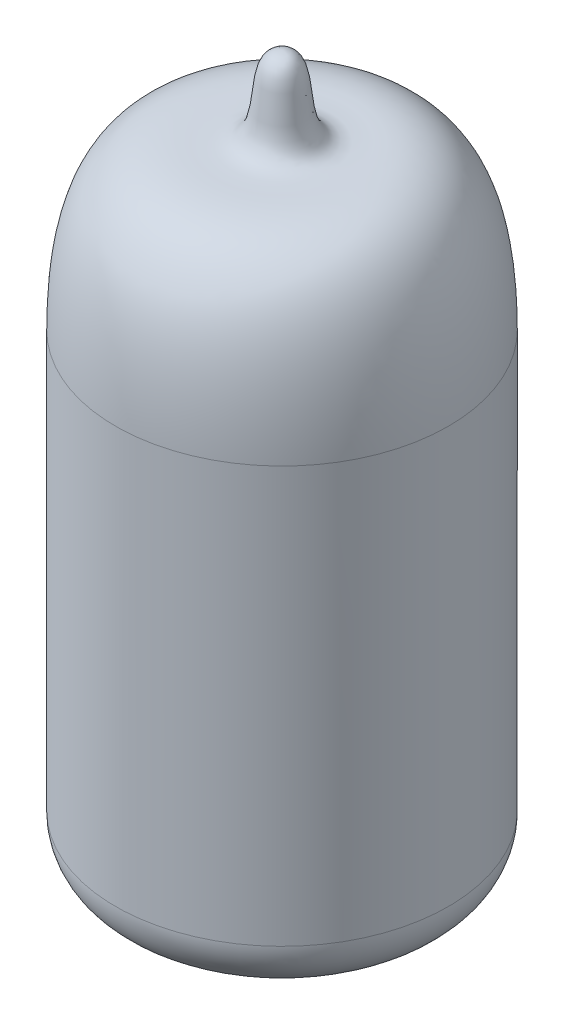
ISO-10303-21;
HEADER;
FILE_DESCRIPTION(('STEP AP214'),'2;1');
FILE_NAME('part.step','',(''),(''),'','','');
FILE_SCHEMA(('AUTOMOTIVE_DESIGN { 1 0 10303 214 1 1 1 1 }'));
ENDSEC;
DATA;
#1=APPLICATION_CONTEXT('core data for automotive mechanical design processes');
#2=APPLICATION_PROTOCOL_DEFINITION('international standard','automotive_design',2000,#1);
#3=PRODUCT_CONTEXT('',#1,'mechanical');
#4=PRODUCT('Part','Part','',(#3));
#5=PRODUCT_RELATED_PRODUCT_CATEGORY('part','',(#4));
#6=PRODUCT_DEFINITION_FORMATION('','',#4);
#7=PRODUCT_DEFINITION_CONTEXT('part definition',#1,'design');
#8=PRODUCT_DEFINITION('design','',#6,#7);
#9=PRODUCT_DEFINITION_SHAPE('','',#8);
#10=(LENGTH_UNIT() NAMED_UNIT(*) SI_UNIT(.MILLI.,.METRE.));
#11=(NAMED_UNIT(*) PLANE_ANGLE_UNIT() SI_UNIT($,.RADIAN.));
#12=(NAMED_UNIT(*) SI_UNIT($,.STERADIAN.) SOLID_ANGLE_UNIT());
#13=UNCERTAINTY_MEASURE_WITH_UNIT(LENGTH_MEASURE(1.E-05),#10,'distance_accuracy_value','');
#14=(GEOMETRIC_REPRESENTATION_CONTEXT(3) GLOBAL_UNCERTAINTY_ASSIGNED_CONTEXT((#13)) GLOBAL_UNIT_ASSIGNED_CONTEXT((#10,
#11,#12)) REPRESENTATION_CONTEXT('',''));
#15=CARTESIAN_POINT('',(0.,0.,0.));
#16=DIRECTION('',(0.,0.,1.));
#17=DIRECTION('',(1.,0.,0.));
#18=AXIS2_PLACEMENT_3D('',#15,#16,#17);
#19=CARTESIAN_POINT('',(0.,0.,0.));
#20=DIRECTION('',(0.,-1.,0.));
#21=DIRECTION('',(0.,0.,-1.));
#22=AXIS2_PLACEMENT_3D('',#19,#20,#21);
#23=PLANE('',#22);
#24=CARTESIAN_POINT('',(0.,0.,0.));
#25=DIRECTION('',(0.,-1.,0.));
#26=DIRECTION('',(0.,0.,-1.));
#27=AXIS2_PLACEMENT_3D('',#24,#25,#26);
#28=CIRCLE('',#27,7.5);
#29=CARTESIAN_POINT('',(0.,0.,-7.5));
#30=VERTEX_POINT('',#29);
#31=EDGE_CURVE('E11',#30,#30,#28,.T.);
#32=ORIENTED_EDGE('',*,*,#31,.T.);
#33=EDGE_LOOP('',(#32));
#34=FACE_BOUND('',#33,.T.);
#35=ADVANCED_FACE('F35',(#34),#23,.T.);
#36=CARTESIAN_POINT('',(0.,3.5,0.));
#37=DIRECTION('',(0.,-1.,0.));
#38=DIRECTION('',(0.,0.,-1.));
#39=AXIS2_PLACEMENT_3D('',#36,#37,#38);
#40=TOROIDAL_SURFACE('',#39,7.5,3.5);
#41=CARTESIAN_POINT('',(0.,3.5,0.));
#42=DIRECTION('',(0.,-1.,0.));
#43=DIRECTION('',(0.,0.,-1.));
#44=AXIS2_PLACEMENT_3D('',#41,#42,#43);
#45=CIRCLE('',#44,11.);
#46=CARTESIAN_POINT('',(0.,3.5,-11.));
#47=VERTEX_POINT('',#46);
#48=EDGE_CURVE('E43',#47,#47,#45,.T.);
#49=ORIENTED_EDGE('',*,*,#48,.T.);
#50=EDGE_LOOP('',(#49));
#51=FACE_BOUND('',#50,.T.);
#52=ORIENTED_EDGE('',*,*,#31,.F.);
#53=EDGE_LOOP('',(#52));
#54=FACE_BOUND('',#53,.T.);
#55=ADVANCED_FACE('F90',(#51,#54),#40,.T.);
#56=CARTESIAN_POINT('',(0.,0.,0.));
#57=DIRECTION('',(0.,-1.,0.));
#58=DIRECTION('',(0.,0.,-1.));
#59=AXIS2_PLACEMENT_3D('',#56,#57,#58);
#60=CYLINDRICAL_SURFACE('',#59,11.);
#61=CARTESIAN_POINT('',(0.,31.,0.));
#62=DIRECTION('',(0.,-1.,0.));
#63=DIRECTION('',(0.,0.,-1.));
#64=AXIS2_PLACEMENT_3D('',#61,#62,#63);
#65=CIRCLE('',#64,11.);
#66=CARTESIAN_POINT('',(0.,31.,-11.));
#67=VERTEX_POINT('',#66);
#68=EDGE_CURVE('E56',#67,#67,#65,.T.);
#69=ORIENTED_EDGE('',*,*,#68,.T.);
#70=EDGE_LOOP('',(#69));
#71=FACE_BOUND('',#70,.T.);
#72=ORIENTED_EDGE('',*,*,#48,.F.);
#73=EDGE_LOOP('',(#72));
#74=FACE_BOUND('',#73,.T.);
#75=ADVANCED_FACE('F52',(#71,#74),#60,.T.);
#76=CARTESIAN_POINT('',(11.,31.,0.));
#77=CARTESIAN_POINT('',(11.,43.7319325552202,0.));
#78=CARTESIAN_POINT('',(3.69077207768073,40.9093323354289,0.));
#79=CARTESIAN_POINT('',(0.839979318641004,43.0980367156517,0.));
#80=CARTESIAN_POINT('',(1.86850886787575,47.,0.));
#81=CARTESIAN_POINT('',(0.,47.,0.));
#82=B_SPLINE_CURVE_WITH_KNOTS('',3,(#76,#77,#78,#79,#80,#81),.UNSPECIFIED.,.F.,.F.,(4,1,1,4),
(0.,0.442647073751262,0.542647073751262,1.),.UNSPECIFIED.);
#83=CARTESIAN_POINT('',(0.,0.,0.));
#84=DIRECTION('',(0.,-1.,0.));
#85=AXIS1_PLACEMENT('',#83,#84);
#86=SURFACE_OF_REVOLUTION('',#82,#85);
#87=CARTESIAN_POINT('',(0.,47.,0.));
#88=VERTEX_POINT('',#87);
#89=VERTEX_LOOP('',#88);
#90=FACE_BOUND('',#89,.T.);
#91=ORIENTED_EDGE('',*,*,#68,.F.);
#92=EDGE_LOOP('',(#91));
#93=FACE_BOUND('',#92,.T.);
#94=ADVANCED_FACE('F49',(#90,#93),#86,.F.);
#95=CLOSED_SHELL('',(#35,#55,#75,#94));
#96=CARTESIAN_POINT('',(0.,46.7,0.));
#97=CARTESIAN_POINT('',(0.0898357826691429,46.7,0.));
#98=CARTESIAN_POINT('',(0.28673048239276,46.6754401385309,0.));
#99=CARTESIAN_POINT('',(0.526826615807173,46.5613706954186,0.));
#100=CARTESIAN_POINT('',(0.862385088541593,46.1825166195098,0.));
#101=CARTESIAN_POINT('',(1.0446519807235,45.2078681354846,0.));
#102=CARTESIAN_POINT('',(1.15328299522645,44.0768963771637,0.));
#103=CARTESIAN_POINT('',(1.2795789795391,43.2248814208197,0.));
#104=CARTESIAN_POINT('',(1.52613051054153,42.4403502352427,0.));
#105=CARTESIAN_POINT('',(2.00467884248594,41.7697419587973,0.));
#106=CARTESIAN_POINT('',(2.89361025329985,41.4235895128291,0.));
#107=CARTESIAN_POINT('',(4.08689834944002,41.4554265413539,0.));
#108=CARTESIAN_POINT('',(5.49391671584979,41.4635820597875,0.));
#109=CARTESIAN_POINT('',(6.96424187027185,41.1862983499595,0.));
#110=CARTESIAN_POINT('',(8.12378442419126,40.4977109352654,0.));
#111=CARTESIAN_POINT('',(8.96560673213867,39.5147022900235,0.));
#112=CARTESIAN_POINT('',(9.53550929824174,38.514305141312,0.));
#113=CARTESIAN_POINT('',(10.0208752784327,37.2076927017216,0.));
#114=CARTESIAN_POINT('',(10.3972501092439,35.5591458477215,0.));
#115=CARTESIAN_POINT('',(10.6003646952281,33.8592381859503,0.));
#116=CARTESIAN_POINT('',(10.6852497453483,32.3089410905985,0.));
#117=CARTESIAN_POINT('',(10.7,31.4275185788067,0.));
#118=CARTESIAN_POINT('',(10.7,31.,0.));
#119=B_SPLINE_CURVE_WITH_KNOTS('',3,(#96,#97,#98,#99,#100,#101,#102,#103,#104,#105,#106,#107,
#108,#109,#110,#111,#112,#113,#114,#115,#116,#117,#118),.UNSPECIFIED.,.F.,.F.,(4,1,1,1,1,1,1,1,
1,1,1,1,1,1,1,1,1,1,1,1,4),(0.,0.03125,0.0625,0.125,0.25,0.3125,0.375,0.4375,0.5,0.5625,0.625,
0.6875,0.75,0.8125,0.84375,0.875,0.90625,0.9375,0.96875,0.984375,1.),.UNSPECIFIED.);
#120=CARTESIAN_POINT('',(0.,0.,0.));
#121=DIRECTION('',(0.,-1.,0.));
#122=AXIS1_PLACEMENT('',#120,#121);
#123=SURFACE_OF_REVOLUTION('',#119,#122);
#124=CARTESIAN_POINT('',(0.,31.,0.));
#125=DIRECTION('',(0.,-1.,0.));
#126=DIRECTION('',(0.,0.,-1.));
#127=AXIS2_PLACEMENT_3D('',#124,#125,#126);
#128=CIRCLE('',#127,10.7);
#129=CARTESIAN_POINT('',(0.,31.,-10.7));
#130=VERTEX_POINT('',#129);
#131=EDGE_CURVE('E58',#130,#130,#128,.T.);
#132=ORIENTED_EDGE('',*,*,#131,.T.);
#133=EDGE_LOOP('',(#132));
#134=FACE_BOUND('',#133,.T.);
#135=CARTESIAN_POINT('',(0.,46.7,0.));
#136=VERTEX_POINT('',#135);
#137=VERTEX_LOOP('',#136);
#138=FACE_BOUND('',#137,.T.);
#139=ADVANCED_FACE('F81',(#134,#138),#123,.F.);
#140=CARTESIAN_POINT('',(0.,0.,0.));
#141=DIRECTION('',(0.,-1.,0.));
#142=DIRECTION('',(0.,0.,-1.));
#143=AXIS2_PLACEMENT_3D('',#140,#141,#142);
#144=CYLINDRICAL_SURFACE('',#143,10.7);
#145=CARTESIAN_POINT('',(0.,5.88640065999707,0.));
#146=DIRECTION('',(0.,-1.,0.));
#147=DIRECTION('',(0.,0.,-1.));
#148=AXIS2_PLACEMENT_3D('',#145,#146,#147);
#149=CIRCLE('',#148,10.7);
#150=CARTESIAN_POINT('',(0.,5.88640065999707,-10.7));
#151=VERTEX_POINT('',#150);
#152=EDGE_CURVE('E62',#151,#151,#149,.T.);
#153=ORIENTED_EDGE('',*,*,#152,.T.);
#154=EDGE_LOOP('',(#153));
#155=FACE_BOUND('',#154,.T.);
#156=ORIENTED_EDGE('',*,*,#131,.F.);
#157=EDGE_LOOP('',(#156));
#158=FACE_BOUND('',#157,.T.);
#159=ADVANCED_FACE('F84',(#155,#158),#144,.F.);
#160=CARTESIAN_POINT('',(0.,5.88640065999707,0.));
#161=DIRECTION('',(0.,-1.,0.));
#162=DIRECTION('',(0.,0.,-1.));
#163=AXIS2_PLACEMENT_3D('',#160,#161,#162);
#164=TOROIDAL_SURFACE('',#163,7.50000000000068,3.19999999999966);
#165=CARTESIAN_POINT('',(0.,2.68640065999741,0.));
#166=DIRECTION('',(0.,-1.,0.));
#167=DIRECTION('',(0.,0.,-1.));
#168=AXIS2_PLACEMENT_3D('',#165,#166,#167);
#169=CIRCLE('',#168,7.50000000000067);
#170=CARTESIAN_POINT('',(0.,2.68640065999741,-7.50000000000067));
#171=VERTEX_POINT('',#170);
#172=EDGE_CURVE('E67',#171,#171,#169,.T.);
#173=ORIENTED_EDGE('',*,*,#172,.T.);
#174=EDGE_LOOP('',(#173));
#175=FACE_BOUND('',#174,.T.);
#176=ORIENTED_EDGE('',*,*,#152,.F.);
#177=EDGE_LOOP('',(#176));
#178=FACE_BOUND('',#177,.T.);
#179=ADVANCED_FACE('F135',(#175,#178),#164,.F.);
#180=CARTESIAN_POINT('',(0.,2.68640065999724,0.));
#181=DIRECTION('',(0.,1.,0.));
#182=DIRECTION('',(0.,0.,1.));
#183=AXIS2_PLACEMENT_3D('',#180,#181,#182);
#184=PLANE('',#183);
#185=ORIENTED_EDGE('',*,*,#172,.F.);
#186=EDGE_LOOP('',(#185));
#187=FACE_BOUND('',#186,.T.);
#188=ADVANCED_FACE('F144',(#187),#184,.T.);
#189=CLOSED_SHELL('',(#139,#159,#179,#188));
#190=ORIENTED_CLOSED_SHELL('',*,#189,.T.);
#191=BREP_WITH_VOIDS('B2',#95,(#190));
#192=ADVANCED_BREP_SHAPE_REPRESENTATION('',(#18,#191),#14);
#193=SHAPE_DEFINITION_REPRESENTATION(#9,#192);
ENDSEC;
END-ISO-10303-21;
